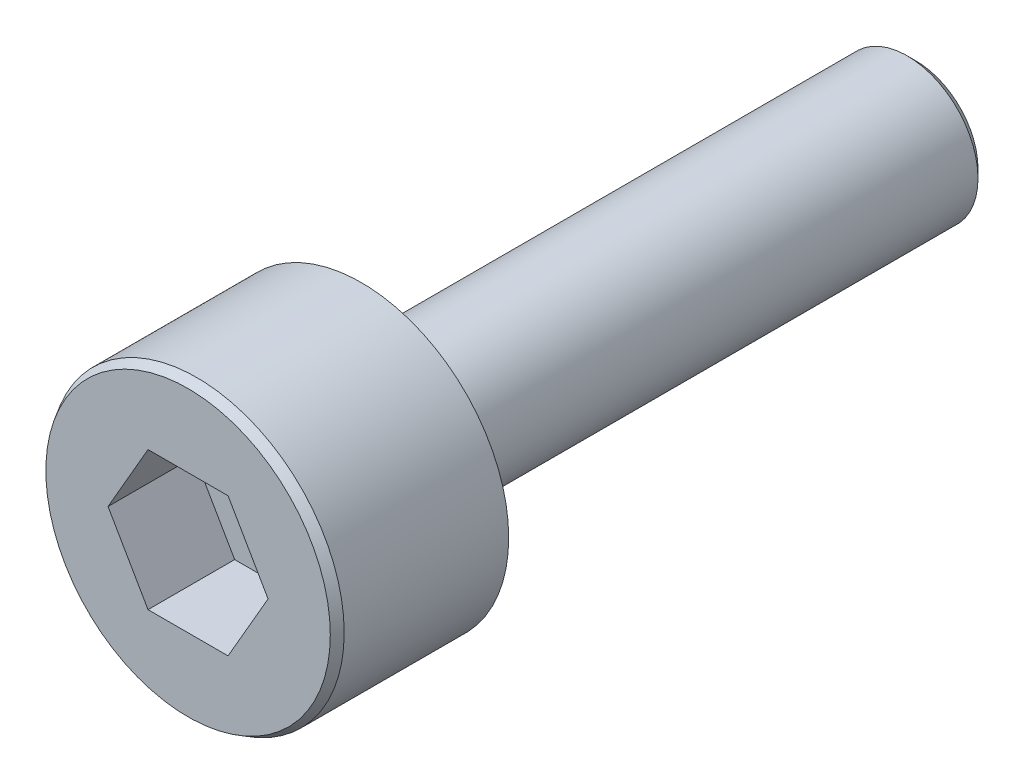
ISO-10303-21;
HEADER;
FILE_DESCRIPTION(('STEP AP214'),'2;1');
FILE_NAME('part.step','',(''),(''),'','','');
FILE_SCHEMA(('AUTOMOTIVE_DESIGN { 1 0 10303 214 1 1 1 1 }'));
ENDSEC;
DATA;
#1=APPLICATION_CONTEXT('core data for automotive mechanical design processes');
#2=APPLICATION_PROTOCOL_DEFINITION('international standard','automotive_design',2000,#1);
#3=PRODUCT_CONTEXT('',#1,'mechanical');
#4=PRODUCT('Part','Part','',(#3));
#5=PRODUCT_RELATED_PRODUCT_CATEGORY('part','',(#4));
#6=PRODUCT_DEFINITION_FORMATION('','',#4);
#7=PRODUCT_DEFINITION_CONTEXT('part definition',#1,'design');
#8=PRODUCT_DEFINITION('design','',#6,#7);
#9=PRODUCT_DEFINITION_SHAPE('','',#8);
#10=(LENGTH_UNIT() NAMED_UNIT(*) SI_UNIT(.MILLI.,.METRE.));
#11=(NAMED_UNIT(*) PLANE_ANGLE_UNIT() SI_UNIT($,.RADIAN.));
#12=(NAMED_UNIT(*) SI_UNIT($,.STERADIAN.) SOLID_ANGLE_UNIT());
#13=UNCERTAINTY_MEASURE_WITH_UNIT(LENGTH_MEASURE(1.E-05),#10,'distance_accuracy_value','');
#14=(GEOMETRIC_REPRESENTATION_CONTEXT(3) GLOBAL_UNCERTAINTY_ASSIGNED_CONTEXT((#13)) GLOBAL_UNIT_ASSIGNED_CONTEXT((#10,
#11,#12)) REPRESENTATION_CONTEXT('',''));
#15=CARTESIAN_POINT('',(0.,0.,0.));
#16=DIRECTION('',(0.,0.,1.));
#17=DIRECTION('',(1.,0.,0.));
#18=AXIS2_PLACEMENT_3D('',#15,#16,#17);
#19=CARTESIAN_POINT('',(0.,0.,-15.746));
#20=DIRECTION('',(0.,0.,1.));
#21=DIRECTION('',(1.,0.,0.));
#22=AXIS2_PLACEMENT_3D('',#19,#20,#21);
#23=CONICAL_SURFACE('',#22,2.0425,0.785398163397444);
#24=CARTESIAN_POINT('',(0.,0.,-15.746));
#25=DIRECTION('',(0.,0.,1.));
#26=DIRECTION('',(1.,0.,0.));
#27=AXIS2_PLACEMENT_3D('',#24,#25,#26);
#28=CIRCLE('',#27,2.0425);
#29=CARTESIAN_POINT('',(2.0425,0.,-15.746));
#30=VERTEX_POINT('',#29);
#31=EDGE_CURVE('E128',#30,#30,#28,.T.);
#32=ORIENTED_EDGE('',*,*,#31,.F.);
#33=EDGE_LOOP('',(#32));
#34=FACE_BOUND('',#33,.T.);
#35=CARTESIAN_POINT('',(0.,0.,-16.));
#36=DIRECTION('',(0.,0.,-1.));
#37=DIRECTION('',(1.,0.,0.));
#38=AXIS2_PLACEMENT_3D('',#35,#36,#37);
#39=CIRCLE('',#38,1.7885);
#40=CARTESIAN_POINT('',(1.7885,0.,-16.));
#41=VERTEX_POINT('',#40);
#42=EDGE_CURVE('E132',#41,#41,#39,.T.);
#43=ORIENTED_EDGE('',*,*,#42,.F.);
#44=EDGE_LOOP('',(#43));
#45=FACE_BOUND('',#44,.T.);
#46=ADVANCED_FACE('F16',(#34,#45),#23,.T.);
#47=CARTESIAN_POINT('',(0.,0.,5.));
#48=DIRECTION('',(0.,0.,-1.));
#49=DIRECTION('',(-1.,0.,0.));
#50=AXIS2_PLACEMENT_3D('',#47,#48,#49);
#51=CONICAL_SURFACE('',#50,4.10335303162583,0.523598775598305);
#52=CARTESIAN_POINT('',(0.,0.,4.746));
#53=DIRECTION('',(0.,0.,-1.));
#54=DIRECTION('',(1.,0.,0.));
#55=AXIS2_PLACEMENT_3D('',#52,#53,#54);
#56=CIRCLE('',#55,4.25);
#57=CARTESIAN_POINT('',(4.25,0.,4.746));
#58=VERTEX_POINT('',#57);
#59=EDGE_CURVE('E11',#58,#58,#56,.T.);
#60=ORIENTED_EDGE('',*,*,#59,.F.);
#61=EDGE_LOOP('',(#60));
#62=FACE_BOUND('',#61,.T.);
#63=CARTESIAN_POINT('',(0.,0.,5.));
#64=DIRECTION('',(0.,0.,1.));
#65=DIRECTION('',(1.,0.,0.));
#66=AXIS2_PLACEMENT_3D('',#63,#64,#65);
#67=CIRCLE('',#66,4.10335303162583);
#68=CARTESIAN_POINT('',(4.10335303162583,0.,5.));
#69=VERTEX_POINT('',#68);
#70=EDGE_CURVE('E126',#69,#69,#67,.T.);
#71=ORIENTED_EDGE('',*,*,#70,.F.);
#72=EDGE_LOOP('',(#71));
#73=FACE_BOUND('',#72,.T.);
#74=ADVANCED_FACE('F141',(#62,#73),#51,.T.);
#75=CARTESIAN_POINT('',(0.,0.,5.));
#76=DIRECTION('',(0.,0.,-1.));
#77=DIRECTION('',(-1.,0.,0.));
#78=AXIS2_PLACEMENT_3D('',#75,#76,#77);
#79=CYLINDRICAL_SURFACE('',#78,4.25);
#80=CARTESIAN_POINT('',(0.,0.,0.));
#81=DIRECTION('',(0.,0.,1.));
#82=DIRECTION('',(1.,0.,0.));
#83=AXIS2_PLACEMENT_3D('',#80,#81,#82);
#84=CIRCLE('',#83,4.25);
#85=CARTESIAN_POINT('',(4.25,0.,0.));
#86=VERTEX_POINT('',#85);
#87=EDGE_CURVE('E26',#86,#86,#84,.T.);
#88=ORIENTED_EDGE('',*,*,#87,.T.);
#89=EDGE_LOOP('',(#88));
#90=FACE_BOUND('',#89,.T.);
#91=ORIENTED_EDGE('',*,*,#59,.T.);
#92=EDGE_LOOP('',(#91));
#93=FACE_BOUND('',#92,.T.);
#94=ADVANCED_FACE('F150',(#90,#93),#79,.T.);
#95=CARTESIAN_POINT('',(0.,0.,-16.));
#96=DIRECTION('',(0.,0.,1.));
#97=DIRECTION('',(1.,0.,0.));
#98=AXIS2_PLACEMENT_3D('',#95,#96,#97);
#99=CYLINDRICAL_SURFACE('',#98,2.0425);
#100=CARTESIAN_POINT('',(0.,0.,0.));
#101=DIRECTION('',(0.,0.,1.));
#102=DIRECTION('',(1.,0.,0.));
#103=AXIS2_PLACEMENT_3D('',#100,#101,#102);
#104=CIRCLE('',#103,2.0425);
#105=CARTESIAN_POINT('',(2.0425,0.,0.));
#106=VERTEX_POINT('',#105);
#107=EDGE_CURVE('E123',#106,#106,#104,.T.);
#108=ORIENTED_EDGE('',*,*,#107,.F.);
#109=EDGE_LOOP('',(#108));
#110=FACE_BOUND('',#109,.T.);
#111=ORIENTED_EDGE('',*,*,#31,.T.);
#112=EDGE_LOOP('',(#111));
#113=FACE_BOUND('',#112,.T.);
#114=ADVANCED_FACE('F157',(#110,#113),#99,.T.);
#115=CARTESIAN_POINT('',(0.,0.,-16.));
#116=DIRECTION('',(0.,0.,1.));
#117=DIRECTION('',(1.,0.,0.));
#118=AXIS2_PLACEMENT_3D('',#115,#116,#117);
#119=PLANE('',#118);
#120=ORIENTED_EDGE('',*,*,#42,.T.);
#121=EDGE_LOOP('',(#120));
#122=FACE_BOUND('',#121,.T.);
#123=ADVANCED_FACE('F138',(#122),#119,.F.);
#124=CARTESIAN_POINT('',(0.,0.,5.));
#125=DIRECTION('',(0.,0.,1.));
#126=DIRECTION('',(1.,0.,0.));
#127=AXIS2_PLACEMENT_3D('',#124,#125,#126);
#128=PLANE('',#127);
#129=DIRECTION('',(-0.499478533062096,0.86632626360404,0.));
#130=VECTOR('',#129,1.);
#131=CARTESIAN_POINT('',(2.30779593284038,-0.000347342661728353,5.));
#132=LINE('',#131,#130);
#133=CARTESIAN_POINT('',(2.30779593284038,-0.000347342661728353,5.));
#134=VERTEX_POINT('',#133);
#135=CARTESIAN_POINT('',(1.1545,2.,5.));
#136=VERTEX_POINT('',#135);
#137=EDGE_CURVE('E101',#134,#136,#132,.T.);
#138=ORIENTED_EDGE('',*,*,#137,.F.);
#139=DIRECTION('',(0.499999999999998,0.86602540378444,0.));
#140=VECTOR('',#139,1.);
#141=CARTESIAN_POINT('',(1.15329593284039,-2.,5.));
#142=LINE('',#141,#140);
#143=CARTESIAN_POINT('',(1.15329593284039,-2.,5.));
#144=VERTEX_POINT('',#143);
#145=EDGE_CURVE('E35',#144,#134,#142,.T.);
#146=ORIENTED_EDGE('',*,*,#145,.F.);
#147=DIRECTION('',(1.,0.,0.));
#148=VECTOR('',#147,1.);
#149=CARTESIAN_POINT('',(-1.15570406715961,-2.,5.));
#150=LINE('',#149,#148);
#151=CARTESIAN_POINT('',(-1.15570406715961,-2.,5.));
#152=VERTEX_POINT('',#151);
#153=EDGE_CURVE('E107',#152,#144,#150,.T.);
#154=ORIENTED_EDGE('',*,*,#153,.F.);
#155=DIRECTION('',(0.499478533062096,-0.86632626360404,0.));
#156=VECTOR('',#155,1.);
#157=CARTESIAN_POINT('',(-2.30899999999999,0.000347342661727473,5.));
#158=LINE('',#157,#156);
#159=CARTESIAN_POINT('',(-2.30899999999999,0.000347342661727473,5.));
#160=VERTEX_POINT('',#159);
#161=EDGE_CURVE('E113',#160,#152,#158,.T.);
#162=ORIENTED_EDGE('',*,*,#161,.F.);
#163=DIRECTION('',(-0.499999999999998,-0.86602540378444,0.));
#164=VECTOR('',#163,1.);
#165=CARTESIAN_POINT('',(-1.1545,2.,5.));
#166=LINE('',#165,#164);
#167=CARTESIAN_POINT('',(-1.1545,2.,5.));
#168=VERTEX_POINT('',#167);
#169=EDGE_CURVE('E89',#168,#160,#166,.T.);
#170=ORIENTED_EDGE('',*,*,#169,.F.);
#171=DIRECTION('',(-1.,0.,0.));
#172=VECTOR('',#171,1.);
#173=CARTESIAN_POINT('',(1.1545,2.,5.));
#174=LINE('',#173,#172);
#175=EDGE_CURVE('E87',#136,#168,#174,.T.);
#176=ORIENTED_EDGE('',*,*,#175,.F.);
#177=EDGE_LOOP('',(#138,#146,#154,#162,#170,#176));
#178=FACE_BOUND('',#177,.T.);
#179=ORIENTED_EDGE('',*,*,#70,.T.);
#180=EDGE_LOOP('',(#179));
#181=FACE_BOUND('',#180,.T.);
#182=ADVANCED_FACE('F164',(#178,#181),#128,.T.);
#183=CARTESIAN_POINT('',(0.,0.,0.));
#184=DIRECTION('',(0.,0.,1.));
#185=DIRECTION('',(1.,0.,0.));
#186=AXIS2_PLACEMENT_3D('',#183,#184,#185);
#187=PLANE('',#186);
#188=ORIENTED_EDGE('',*,*,#107,.T.);
#189=EDGE_LOOP('',(#188));
#190=FACE_BOUND('',#189,.T.);
#191=ORIENTED_EDGE('',*,*,#87,.F.);
#192=EDGE_LOOP('',(#191));
#193=FACE_BOUND('',#192,.T.);
#194=ADVANCED_FACE('F167',(#190,#193),#187,.F.);
#195=CARTESIAN_POINT('',(2.30779593284038,-0.000347342661728353,2.5));
#196=DIRECTION('',(0.86632626360404,0.499478533062096,0.));
#197=DIRECTION('',(-0.499478533062096,0.86632626360404,0.));
#198=AXIS2_PLACEMENT_3D('',#195,#196,#197);
#199=PLANE('',#198);
#200=ORIENTED_EDGE('',*,*,#137,.T.);
#201=DIRECTION('',(0.,0.,1.));
#202=VECTOR('',#201,1.);
#203=CARTESIAN_POINT('',(1.1545,2.,2.5));
#204=LINE('',#203,#202);
#205=CARTESIAN_POINT('',(1.1545,2.,2.5));
#206=VERTEX_POINT('',#205);
#207=EDGE_CURVE('E93',#206,#136,#204,.T.);
#208=ORIENTED_EDGE('',*,*,#207,.F.);
#209=DIRECTION('',(-0.499478533062096,0.86632626360404,0.));
#210=VECTOR('',#209,1.);
#211=CARTESIAN_POINT('',(2.30779593284038,-0.000347342661728353,2.5));
#212=LINE('',#211,#210);
#213=CARTESIAN_POINT('',(2.30779593284038,-0.000347342661728353,2.5));
#214=VERTEX_POINT('',#213);
#215=EDGE_CURVE('E91',#214,#206,#212,.T.);
#216=ORIENTED_EDGE('',*,*,#215,.F.);
#217=DIRECTION('',(0.,0.,1.));
#218=VECTOR('',#217,1.);
#219=CARTESIAN_POINT('',(2.30779593284038,-0.000347342661728353,2.5));
#220=LINE('',#219,#218);
#221=EDGE_CURVE('E98',#214,#134,#220,.T.);
#222=ORIENTED_EDGE('',*,*,#221,.T.);
#223=EDGE_LOOP('',(#200,#208,#216,#222));
#224=FACE_BOUND('',#223,.T.);
#225=ADVANCED_FACE('F171',(#224),#199,.F.);
#226=CARTESIAN_POINT('',(1.15329593284039,-2.,2.5));
#227=DIRECTION('',(0.86602540378444,-0.499999999999998,0.));
#228=DIRECTION('',(0.499999999999998,0.86602540378444,0.));
#229=AXIS2_PLACEMENT_3D('',#226,#227,#228);
#230=PLANE('',#229);
#231=ORIENTED_EDGE('',*,*,#145,.T.);
#232=ORIENTED_EDGE('',*,*,#221,.F.);
#233=DIRECTION('',(0.499999999999998,0.86602540378444,0.));
#234=VECTOR('',#233,1.);
#235=CARTESIAN_POINT('',(1.15329593284039,-2.,2.5));
#236=LINE('',#235,#234);
#237=CARTESIAN_POINT('',(1.15329593284039,-2.,2.5));
#238=VERTEX_POINT('',#237);
#239=EDGE_CURVE('E102',#238,#214,#236,.T.);
#240=ORIENTED_EDGE('',*,*,#239,.F.);
#241=DIRECTION('',(0.,0.,1.));
#242=VECTOR('',#241,1.);
#243=CARTESIAN_POINT('',(1.15329593284039,-2.,2.5));
#244=LINE('',#243,#242);
#245=EDGE_CURVE('E105',#238,#144,#244,.T.);
#246=ORIENTED_EDGE('',*,*,#245,.T.);
#247=EDGE_LOOP('',(#231,#232,#240,#246));
#248=FACE_BOUND('',#247,.T.);
#249=ADVANCED_FACE('F175',(#248),#230,.F.);
#250=CARTESIAN_POINT('',(-1.15570406715961,-2.,2.5));
#251=DIRECTION('',(0.,-1.,0.));
#252=DIRECTION('',(0.,0.,-1.));
#253=AXIS2_PLACEMENT_3D('',#250,#251,#252);
#254=PLANE('',#253);
#255=ORIENTED_EDGE('',*,*,#153,.T.);
#256=ORIENTED_EDGE('',*,*,#245,.F.);
#257=DIRECTION('',(1.,0.,0.));
#258=VECTOR('',#257,1.);
#259=CARTESIAN_POINT('',(-1.15570406715961,-2.,2.5));
#260=LINE('',#259,#258);
#261=CARTESIAN_POINT('',(-1.15570406715961,-2.,2.5));
#262=VERTEX_POINT('',#261);
#263=EDGE_CURVE('E104',#262,#238,#260,.T.);
#264=ORIENTED_EDGE('',*,*,#263,.F.);
#265=DIRECTION('',(0.,0.,1.));
#266=VECTOR('',#265,1.);
#267=CARTESIAN_POINT('',(-1.15570406715961,-2.,2.5));
#268=LINE('',#267,#266);
#269=EDGE_CURVE('E110',#262,#152,#268,.T.);
#270=ORIENTED_EDGE('',*,*,#269,.T.);
#271=EDGE_LOOP('',(#255,#256,#264,#270));
#272=FACE_BOUND('',#271,.T.);
#273=ADVANCED_FACE('F179',(#272),#254,.F.);
#274=CARTESIAN_POINT('',(-2.30899999999999,0.000347342661727473,2.5));
#275=DIRECTION('',(-0.86632626360404,-0.499478533062096,0.));
#276=DIRECTION('',(0.499478533062096,-0.86632626360404,0.));
#277=AXIS2_PLACEMENT_3D('',#274,#275,#276);
#278=PLANE('',#277);
#279=ORIENTED_EDGE('',*,*,#161,.T.);
#280=ORIENTED_EDGE('',*,*,#269,.F.);
#281=DIRECTION('',(0.499478533062096,-0.86632626360404,0.));
#282=VECTOR('',#281,1.);
#283=CARTESIAN_POINT('',(-2.30899999999999,0.000347342661727473,2.5));
#284=LINE('',#283,#282);
#285=CARTESIAN_POINT('',(-2.30899999999999,0.000347342661727473,2.5));
#286=VERTEX_POINT('',#285);
#287=EDGE_CURVE('E69',#286,#262,#284,.T.);
#288=ORIENTED_EDGE('',*,*,#287,.F.);
#289=DIRECTION('',(0.,0.,1.));
#290=VECTOR('',#289,1.);
#291=CARTESIAN_POINT('',(-2.30899999999999,0.000347342661727473,2.5));
#292=LINE('',#291,#290);
#293=EDGE_CURVE('E79',#286,#160,#292,.T.);
#294=ORIENTED_EDGE('',*,*,#293,.T.);
#295=EDGE_LOOP('',(#279,#280,#288,#294));
#296=FACE_BOUND('',#295,.T.);
#297=ADVANCED_FACE('F182',(#296),#278,.F.);
#298=CARTESIAN_POINT('',(-1.1545,2.,2.5));
#299=DIRECTION('',(-0.86602540378444,0.499999999999998,0.));
#300=DIRECTION('',(-0.499999999999998,-0.86602540378444,0.));
#301=AXIS2_PLACEMENT_3D('',#298,#299,#300);
#302=PLANE('',#301);
#303=ORIENTED_EDGE('',*,*,#169,.T.);
#304=ORIENTED_EDGE('',*,*,#293,.F.);
#305=DIRECTION('',(-0.499999999999998,-0.86602540378444,0.));
#306=VECTOR('',#305,1.);
#307=CARTESIAN_POINT('',(-1.1545,2.,2.5));
#308=LINE('',#307,#306);
#309=CARTESIAN_POINT('',(-1.1545,2.,2.5));
#310=VERTEX_POINT('',#309);
#311=EDGE_CURVE('E75',#310,#286,#308,.T.);
#312=ORIENTED_EDGE('',*,*,#311,.F.);
#313=DIRECTION('',(0.,0.,1.));
#314=VECTOR('',#313,1.);
#315=CARTESIAN_POINT('',(-1.1545,2.,2.5));
#316=LINE('',#315,#314);
#317=EDGE_CURVE('E78',#310,#168,#316,.T.);
#318=ORIENTED_EDGE('',*,*,#317,.T.);
#319=EDGE_LOOP('',(#303,#304,#312,#318));
#320=FACE_BOUND('',#319,.T.);
#321=ADVANCED_FACE('F77',(#320),#302,.F.);
#322=CARTESIAN_POINT('',(1.1545,2.,2.5));
#323=DIRECTION('',(0.,1.,0.));
#324=DIRECTION('',(-1.,0.,0.));
#325=AXIS2_PLACEMENT_3D('',#322,#323,#324);
#326=PLANE('',#325);
#327=ORIENTED_EDGE('',*,*,#175,.T.);
#328=ORIENTED_EDGE('',*,*,#317,.F.);
#329=DIRECTION('',(-1.,0.,0.));
#330=VECTOR('',#329,1.);
#331=CARTESIAN_POINT('',(1.1545,2.,2.5));
#332=LINE('',#331,#330);
#333=EDGE_CURVE('E20',#206,#310,#332,.T.);
#334=ORIENTED_EDGE('',*,*,#333,.F.);
#335=ORIENTED_EDGE('',*,*,#207,.T.);
#336=EDGE_LOOP('',(#327,#328,#334,#335));
#337=FACE_BOUND('',#336,.T.);
#338=ADVANCED_FACE('F85',(#337),#326,.F.);
#339=CARTESIAN_POINT('',(1.1545,2.,2.5));
#340=DIRECTION('',(0.,0.,1.));
#341=DIRECTION('',(1.,0.,0.));
#342=AXIS2_PLACEMENT_3D('',#339,#340,#341);
#343=PLANE('',#342);
#344=ORIENTED_EDGE('',*,*,#215,.T.);
#345=ORIENTED_EDGE('',*,*,#333,.T.);
#346=ORIENTED_EDGE('',*,*,#311,.T.);
#347=ORIENTED_EDGE('',*,*,#287,.T.);
#348=ORIENTED_EDGE('',*,*,#263,.T.);
#349=ORIENTED_EDGE('',*,*,#239,.T.);
#350=EDGE_LOOP('',(#344,#345,#346,#347,#348,#349));
#351=FACE_BOUND('',#350,.T.);
#352=ADVANCED_FACE('F18',(#351),#343,.T.);
#353=CLOSED_SHELL('',(#46,#74,#94,#114,#123,#182,#194,#225,#249,#273,#297,#321,#338,#352));
#354=MANIFOLD_SOLID_BREP('B1',#353);
#355=ADVANCED_BREP_SHAPE_REPRESENTATION('',(#18,#354),#14);
#356=SHAPE_DEFINITION_REPRESENTATION(#9,#355);
ENDSEC;
END-ISO-10303-21;
